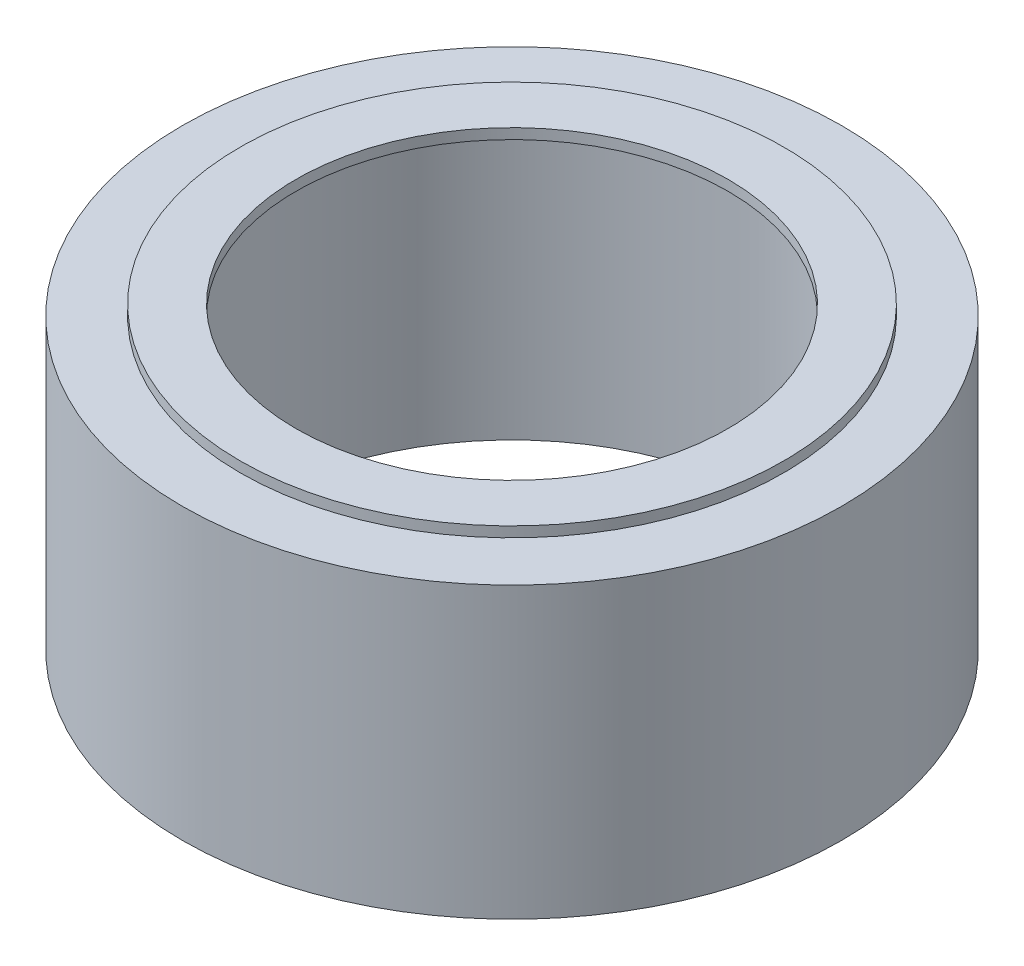
ISO-10303-21;
HEADER;
FILE_DESCRIPTION(('STEP AP214'),'2;1');
FILE_NAME('part.step','',(''),(''),'','','');
FILE_SCHEMA(('AUTOMOTIVE_DESIGN { 1 0 10303 214 1 1 1 1 }'));
ENDSEC;
DATA;
#1=APPLICATION_CONTEXT('core data for automotive mechanical design processes');
#2=APPLICATION_PROTOCOL_DEFINITION('international standard','automotive_design',2000,#1);
#3=PRODUCT_CONTEXT('',#1,'mechanical');
#4=PRODUCT('Part','Part','',(#3));
#5=PRODUCT_RELATED_PRODUCT_CATEGORY('part','',(#4));
#6=PRODUCT_DEFINITION_FORMATION('','',#4);
#7=PRODUCT_DEFINITION_CONTEXT('part definition',#1,'design');
#8=PRODUCT_DEFINITION('design','',#6,#7);
#9=PRODUCT_DEFINITION_SHAPE('','',#8);
#10=(LENGTH_UNIT() NAMED_UNIT(*) SI_UNIT(.MILLI.,.METRE.));
#11=(NAMED_UNIT(*) PLANE_ANGLE_UNIT() SI_UNIT($,.RADIAN.));
#12=(NAMED_UNIT(*) SI_UNIT($,.STERADIAN.) SOLID_ANGLE_UNIT());
#13=UNCERTAINTY_MEASURE_WITH_UNIT(LENGTH_MEASURE(1.E-05),#10,'distance_accuracy_value','');
#14=(GEOMETRIC_REPRESENTATION_CONTEXT(3) GLOBAL_UNCERTAINTY_ASSIGNED_CONTEXT((#13)) GLOBAL_UNIT_ASSIGNED_CONTEXT((#10,
#11,#12)) REPRESENTATION_CONTEXT('',''));
#15=CARTESIAN_POINT('',(0.,0.,0.));
#16=DIRECTION('',(0.,0.,1.));
#17=DIRECTION('',(1.,0.,0.));
#18=AXIS2_PLACEMENT_3D('',#15,#16,#17);
#19=CARTESIAN_POINT('',(0.,14.5,0.));
#20=DIRECTION('',(0.,-1.,0.));
#21=DIRECTION('',(0.,0.,-1.));
#22=AXIS2_PLACEMENT_3D('',#19,#20,#21);
#23=CYLINDRICAL_SURFACE('',#22,10.45);
#24=CARTESIAN_POINT('',(0.,14.5,0.));
#25=DIRECTION('',(0.,1.,0.));
#26=DIRECTION('',(0.,0.,1.));
#27=AXIS2_PLACEMENT_3D('',#24,#25,#26);
#28=CIRCLE('',#27,10.45);
#29=CARTESIAN_POINT('',(0.,14.5,10.45));
#30=VERTEX_POINT('',#29);
#31=EDGE_CURVE('E56',#30,#30,#28,.T.);
#32=ORIENTED_EDGE('',*,*,#31,.T.);
#33=EDGE_LOOP('',(#32));
#34=FACE_BOUND('',#33,.T.);
#35=CARTESIAN_POINT('',(0.,14.,0.));
#36=DIRECTION('',(0.,1.,0.));
#37=DIRECTION('',(0.,0.,1.));
#38=AXIS2_PLACEMENT_3D('',#35,#36,#37);
#39=CIRCLE('',#38,10.45);
#40=CARTESIAN_POINT('',(0.,14.,10.45));
#41=VERTEX_POINT('',#40);
#42=EDGE_CURVE('E62',#41,#41,#39,.T.);
#43=ORIENTED_EDGE('',*,*,#42,.F.);
#44=EDGE_LOOP('',(#43));
#45=FACE_BOUND('',#44,.T.);
#46=ADVANCED_FACE('F49',(#34,#45),#23,.F.);
#47=CARTESIAN_POINT('',(0.,14.5,0.));
#48=DIRECTION('',(0.,-1.,0.));
#49=DIRECTION('',(0.,0.,-1.));
#50=AXIS2_PLACEMENT_3D('',#47,#48,#49);
#51=CYLINDRICAL_SURFACE('',#50,13.15);
#52=CARTESIAN_POINT('',(0.,14.5,0.));
#53=DIRECTION('',(0.,1.,0.));
#54=DIRECTION('',(0.,0.,1.));
#55=AXIS2_PLACEMENT_3D('',#52,#53,#54);
#56=CIRCLE('',#55,13.15);
#57=CARTESIAN_POINT('',(0.,14.5,13.15));
#58=VERTEX_POINT('',#57);
#59=EDGE_CURVE('E11',#58,#58,#56,.T.);
#60=ORIENTED_EDGE('',*,*,#59,.F.);
#61=EDGE_LOOP('',(#60));
#62=FACE_BOUND('',#61,.T.);
#63=CARTESIAN_POINT('',(0.,14.,0.));
#64=DIRECTION('',(0.,1.,0.));
#65=DIRECTION('',(0.,0.,1.));
#66=AXIS2_PLACEMENT_3D('',#63,#64,#65);
#67=CIRCLE('',#66,13.15);
#68=CARTESIAN_POINT('',(0.,14.,13.15));
#69=VERTEX_POINT('',#68);
#70=EDGE_CURVE('E52',#69,#69,#67,.T.);
#71=ORIENTED_EDGE('',*,*,#70,.T.);
#72=EDGE_LOOP('',(#71));
#73=FACE_BOUND('',#72,.T.);
#74=ADVANCED_FACE('F69',(#62,#73),#51,.T.);
#75=CARTESIAN_POINT('',(0.,14.5,0.));
#76=DIRECTION('',(0.,1.,0.));
#77=DIRECTION('',(0.,0.,1.));
#78=AXIS2_PLACEMENT_3D('',#75,#76,#77);
#79=PLANE('',#78);
#80=ORIENTED_EDGE('',*,*,#31,.F.);
#81=EDGE_LOOP('',(#80));
#82=FACE_BOUND('',#81,.T.);
#83=ORIENTED_EDGE('',*,*,#59,.T.);
#84=EDGE_LOOP('',(#83));
#85=FACE_BOUND('',#84,.T.);
#86=ADVANCED_FACE('F73',(#82,#85),#79,.T.);
#87=CARTESIAN_POINT('',(0.,14.,0.));
#88=DIRECTION('',(0.,1.,0.));
#89=DIRECTION('',(0.,0.,1.));
#90=AXIS2_PLACEMENT_3D('',#87,#88,#89);
#91=PLANE('',#90);
#92=ORIENTED_EDGE('',*,*,#42,.T.);
#93=EDGE_LOOP('',(#92));
#94=FACE_BOUND('',#93,.T.);
#95=ORIENTED_EDGE('',*,*,#70,.F.);
#96=EDGE_LOOP('',(#95));
#97=FACE_BOUND('',#96,.T.);
#98=ADVANCED_FACE('F71',(#94,#97),#91,.F.);
#99=CLOSED_SHELL('',(#46,#74,#86,#98));
#100=MANIFOLD_SOLID_BREP('B2',#99);
#101=CARTESIAN_POINT('',(0.,14.,0.));
#102=DIRECTION('',(0.,1.,0.));
#103=DIRECTION('',(0.,0.,1.));
#104=AXIS2_PLACEMENT_3D('',#101,#102,#103);
#105=PLANE('',#104);
#106=CARTESIAN_POINT('',(0.,14.,0.));
#107=DIRECTION('',(0.,1.,0.));
#108=DIRECTION('',(0.,0.,1.));
#109=AXIS2_PLACEMENT_3D('',#106,#107,#108);
#110=CIRCLE('',#109,15.95);
#111=CARTESIAN_POINT('',(0.,14.,15.95));
#112=VERTEX_POINT('',#111);
#113=EDGE_CURVE('E48',#112,#112,#110,.T.);
#114=ORIENTED_EDGE('',*,*,#113,.T.);
#115=EDGE_LOOP('',(#114));
#116=FACE_BOUND('',#115,.T.);
#117=CARTESIAN_POINT('',(0.,14.,0.));
#118=DIRECTION('',(0.,1.,0.));
#119=DIRECTION('',(0.,0.,1.));
#120=AXIS2_PLACEMENT_3D('',#117,#118,#119);
#121=CIRCLE('',#120,12.45);
#122=CARTESIAN_POINT('',(0.,14.,12.45));
#123=VERTEX_POINT('',#122);
#124=EDGE_CURVE('E136',#123,#123,#121,.T.);
#125=ORIENTED_EDGE('',*,*,#124,.F.);
#126=EDGE_LOOP('',(#125));
#127=FACE_BOUND('',#126,.T.);
#128=ADVANCED_FACE('F125',(#116,#127),#105,.T.);
#129=CARTESIAN_POINT('',(0.,0.,0.));
#130=DIRECTION('',(0.,1.,0.));
#131=DIRECTION('',(0.,0.,1.));
#132=AXIS2_PLACEMENT_3D('',#129,#130,#131);
#133=PLANE('',#132);
#134=CARTESIAN_POINT('',(0.,0.,0.));
#135=DIRECTION('',(0.,1.,0.));
#136=DIRECTION('',(0.,0.,1.));
#137=AXIS2_PLACEMENT_3D('',#134,#135,#136);
#138=CIRCLE('',#137,15.95);
#139=CARTESIAN_POINT('',(0.,0.,15.95));
#140=VERTEX_POINT('',#139);
#141=EDGE_CURVE('E129',#140,#140,#138,.T.);
#142=ORIENTED_EDGE('',*,*,#141,.F.);
#143=EDGE_LOOP('',(#142));
#144=FACE_BOUND('',#143,.T.);
#145=CARTESIAN_POINT('',(0.,0.,0.));
#146=DIRECTION('',(0.,1.,0.));
#147=DIRECTION('',(0.,0.,1.));
#148=AXIS2_PLACEMENT_3D('',#145,#146,#147);
#149=CIRCLE('',#148,12.45);
#150=CARTESIAN_POINT('',(0.,0.,12.45));
#151=VERTEX_POINT('',#150);
#152=EDGE_CURVE('E138',#151,#151,#149,.T.);
#153=ORIENTED_EDGE('',*,*,#152,.T.);
#154=EDGE_LOOP('',(#153));
#155=FACE_BOUND('',#154,.T.);
#156=ADVANCED_FACE('F148',(#144,#155),#133,.F.);
#157=CARTESIAN_POINT('',(0.,14.,0.));
#158=DIRECTION('',(0.,-1.,0.));
#159=DIRECTION('',(0.,0.,-1.));
#160=AXIS2_PLACEMENT_3D('',#157,#158,#159);
#161=CYLINDRICAL_SURFACE('',#160,15.95);
#162=ORIENTED_EDGE('',*,*,#113,.F.);
#163=EDGE_LOOP('',(#162));
#164=FACE_BOUND('',#163,.T.);
#165=ORIENTED_EDGE('',*,*,#141,.T.);
#166=EDGE_LOOP('',(#165));
#167=FACE_BOUND('',#166,.T.);
#168=ADVANCED_FACE('F127',(#164,#167),#161,.T.);
#169=CARTESIAN_POINT('',(0.,14.,0.));
#170=DIRECTION('',(0.,-1.,0.));
#171=DIRECTION('',(0.,0.,-1.));
#172=AXIS2_PLACEMENT_3D('',#169,#170,#171);
#173=CYLINDRICAL_SURFACE('',#172,12.45);
#174=ORIENTED_EDGE('',*,*,#124,.T.);
#175=EDGE_LOOP('',(#174));
#176=FACE_BOUND('',#175,.T.);
#177=ORIENTED_EDGE('',*,*,#152,.F.);
#178=EDGE_LOOP('',(#177));
#179=FACE_BOUND('',#178,.T.);
#180=ADVANCED_FACE('F144',(#176,#179),#173,.F.);
#181=CLOSED_SHELL('',(#128,#156,#168,#180));
#182=MANIFOLD_SOLID_BREP('B6',#181);
#183=ADVANCED_BREP_SHAPE_REPRESENTATION('',(#18,#100,#182),#14);
#184=SHAPE_DEFINITION_REPRESENTATION(#9,#183);
ENDSEC;
END-ISO-10303-21;
